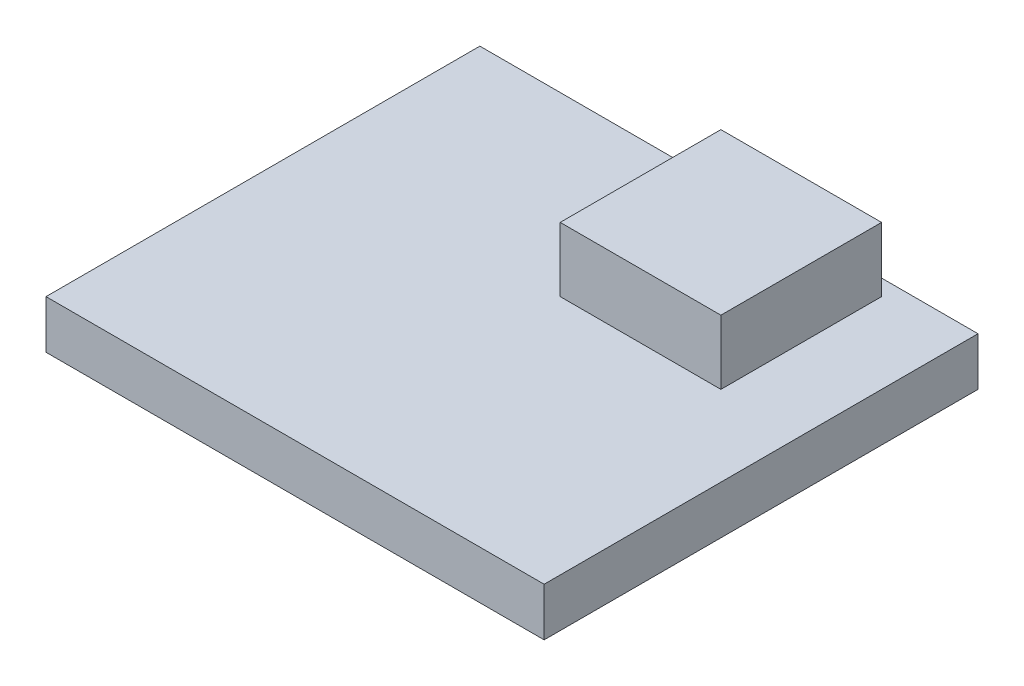
ISO-10303-21;
HEADER;
FILE_DESCRIPTION(('STEP AP214'),'2;1');
FILE_NAME('part.step','',(''),(''),'','','');
FILE_SCHEMA(('AUTOMOTIVE_DESIGN { 1 0 10303 214 1 1 1 1 }'));
ENDSEC;
DATA;
#1=APPLICATION_CONTEXT('core data for automotive mechanical design processes');
#2=APPLICATION_PROTOCOL_DEFINITION('international standard','automotive_design',2000,#1);
#3=PRODUCT_CONTEXT('',#1,'mechanical');
#4=PRODUCT('Part','Part','',(#3));
#5=PRODUCT_RELATED_PRODUCT_CATEGORY('part','',(#4));
#6=PRODUCT_DEFINITION_FORMATION('','',#4);
#7=PRODUCT_DEFINITION_CONTEXT('part definition',#1,'design');
#8=PRODUCT_DEFINITION('design','',#6,#7);
#9=PRODUCT_DEFINITION_SHAPE('','',#8);
#10=(LENGTH_UNIT() NAMED_UNIT(*) SI_UNIT(.MILLI.,.METRE.));
#11=(NAMED_UNIT(*) PLANE_ANGLE_UNIT() SI_UNIT($,.RADIAN.));
#12=(NAMED_UNIT(*) SI_UNIT($,.STERADIAN.) SOLID_ANGLE_UNIT());
#13=UNCERTAINTY_MEASURE_WITH_UNIT(LENGTH_MEASURE(1.E-05),#10,'distance_accuracy_value','');
#14=(GEOMETRIC_REPRESENTATION_CONTEXT(3) GLOBAL_UNCERTAINTY_ASSIGNED_CONTEXT((#13)) GLOBAL_UNIT_ASSIGNED_CONTEXT((#10,
#11,#12)) REPRESENTATION_CONTEXT('',''));
#15=CARTESIAN_POINT('',(0.,0.,0.));
#16=DIRECTION('',(0.,0.,1.));
#17=DIRECTION('',(1.,0.,0.));
#18=AXIS2_PLACEMENT_3D('',#15,#16,#17);
#19=CARTESIAN_POINT('',(0.,3.,0.));
#20=DIRECTION('',(0.,1.,0.));
#21=DIRECTION('',(0.,0.,1.));
#22=AXIS2_PLACEMENT_3D('',#19,#20,#21);
#23=PLANE('',#22);
#24=DIRECTION('',(0.,0.,1.));
#25=VECTOR('',#24,1.);
#26=CARTESIAN_POINT('',(-15.5,3.,-11.7316513761468));
#27=LINE('',#26,#25);
#28=CARTESIAN_POINT('',(-15.5,3.,-11.7316513761468));
#29=VERTEX_POINT('',#28);
#30=CARTESIAN_POINT('',(-15.5,3.,15.2683486238532));
#31=VERTEX_POINT('',#30);
#32=EDGE_CURVE('E140',#29,#31,#27,.T.);
#33=ORIENTED_EDGE('',*,*,#32,.T.);
#34=DIRECTION('',(1.,0.,0.));
#35=VECTOR('',#34,1.);
#36=CARTESIAN_POINT('',(-15.5,3.,15.2683486238532));
#37=LINE('',#36,#35);
#38=CARTESIAN_POINT('',(15.5,3.,15.2683486238532));
#39=VERTEX_POINT('',#38);
#40=EDGE_CURVE('E85',#31,#39,#37,.T.);
#41=ORIENTED_EDGE('',*,*,#40,.T.);
#42=DIRECTION('',(0.,0.,-1.));
#43=VECTOR('',#42,1.);
#44=CARTESIAN_POINT('',(15.5,3.,-11.7316513761468));
#45=LINE('',#44,#43);
#46=CARTESIAN_POINT('',(15.5,3.,-11.7316513761468));
#47=VERTEX_POINT('',#46);
#48=EDGE_CURVE('E143',#39,#47,#45,.T.);
#49=ORIENTED_EDGE('',*,*,#48,.T.);
#50=DIRECTION('',(-1.,0.,0.));
#51=VECTOR('',#50,1.);
#52=CARTESIAN_POINT('',(-15.5,3.,-11.7316513761468));
#53=LINE('',#52,#51);
#54=EDGE_CURVE('E57',#47,#29,#53,.T.);
#55=ORIENTED_EDGE('',*,*,#54,.T.);
#56=EDGE_LOOP('',(#33,#41,#49,#55));
#57=FACE_BOUND('',#56,.T.);
#58=DIRECTION('',(1.,0.,0.));
#59=VECTOR('',#58,1.);
#60=CARTESIAN_POINT('',(0.500000000000014,3.,-0.731651376146787));
#61=LINE('',#60,#59);
#62=CARTESIAN_POINT('',(0.500000000000014,3.,-0.731651376146787));
#63=VERTEX_POINT('',#62);
#64=CARTESIAN_POINT('',(10.5,3.,-0.731651376146787));
#65=VERTEX_POINT('',#64);
#66=EDGE_CURVE('E263',#63,#65,#61,.T.);
#67=ORIENTED_EDGE('',*,*,#66,.F.);
#68=DIRECTION('',(0.,0.,1.));
#69=VECTOR('',#68,1.);
#70=CARTESIAN_POINT('',(0.500000000000013,3.,-10.7316513761468));
#71=LINE('',#70,#69);
#72=CARTESIAN_POINT('',(0.500000000000013,3.,-10.7316513761468));
#73=VERTEX_POINT('',#72);
#74=EDGE_CURVE('E130',#73,#63,#71,.T.);
#75=ORIENTED_EDGE('',*,*,#74,.F.);
#76=DIRECTION('',(-1.,0.,0.));
#77=VECTOR('',#76,1.);
#78=CARTESIAN_POINT('',(0.500000000000013,3.,-10.7316513761468));
#79=LINE('',#78,#77);
#80=CARTESIAN_POINT('',(10.5,3.,-10.7316513761468));
#81=VERTEX_POINT('',#80);
#82=EDGE_CURVE('E126',#81,#73,#79,.T.);
#83=ORIENTED_EDGE('',*,*,#82,.F.);
#84=DIRECTION('',(0.,0.,-1.));
#85=VECTOR('',#84,1.);
#86=CARTESIAN_POINT('',(10.5,3.,-10.7316513761468));
#87=LINE('',#86,#85);
#88=EDGE_CURVE('E260',#65,#81,#87,.T.);
#89=ORIENTED_EDGE('',*,*,#88,.F.);
#90=EDGE_LOOP('',(#67,#75,#83,#89));
#91=FACE_BOUND('',#90,.T.);
#92=ADVANCED_FACE('F33',(#57,#91),#23,.T.);
#93=CARTESIAN_POINT('',(-15.5,3.,-11.7316513761468));
#94=DIRECTION('',(1.,0.,0.));
#95=DIRECTION('',(0.,0.,-1.));
#96=AXIS2_PLACEMENT_3D('',#93,#94,#95);
#97=PLANE('',#96);
#98=DIRECTION('',(0.,0.,1.));
#99=VECTOR('',#98,1.);
#100=CARTESIAN_POINT('',(-15.5,0.,-11.7316513761468));
#101=LINE('',#100,#99);
#102=CARTESIAN_POINT('',(-15.5,0.,-11.7316513761468));
#103=VERTEX_POINT('',#102);
#104=CARTESIAN_POINT('',(-15.5,0.,15.2683486238532));
#105=VERTEX_POINT('',#104);
#106=EDGE_CURVE('E132',#103,#105,#101,.T.);
#107=ORIENTED_EDGE('',*,*,#106,.T.);
#108=DIRECTION('',(0.,-1.,0.));
#109=VECTOR('',#108,1.);
#110=CARTESIAN_POINT('',(-15.5,3.,15.2683486238532));
#111=LINE('',#110,#109);
#112=EDGE_CURVE('E11',#31,#105,#111,.T.);
#113=ORIENTED_EDGE('',*,*,#112,.F.);
#114=ORIENTED_EDGE('',*,*,#32,.F.);
#115=DIRECTION('',(0.,-1.,0.));
#116=VECTOR('',#115,1.);
#117=CARTESIAN_POINT('',(-15.5,3.,-11.7316513761468));
#118=LINE('',#117,#116);
#119=EDGE_CURVE('E145',#29,#103,#118,.T.);
#120=ORIENTED_EDGE('',*,*,#119,.T.);
#121=EDGE_LOOP('',(#107,#113,#114,#120));
#122=FACE_BOUND('',#121,.T.);
#123=ADVANCED_FACE('F35',(#122),#97,.F.);
#124=CARTESIAN_POINT('',(-15.5,3.,15.2683486238532));
#125=DIRECTION('',(0.,0.,-1.));
#126=DIRECTION('',(-1.,0.,0.));
#127=AXIS2_PLACEMENT_3D('',#124,#125,#126);
#128=PLANE('',#127);
#129=DIRECTION('',(1.,0.,0.));
#130=VECTOR('',#129,1.);
#131=CARTESIAN_POINT('',(-15.5,0.,15.2683486238532));
#132=LINE('',#131,#130);
#133=CARTESIAN_POINT('',(15.5,0.,15.2683486238532));
#134=VERTEX_POINT('',#133);
#135=EDGE_CURVE('E135',#105,#134,#132,.T.);
#136=ORIENTED_EDGE('',*,*,#135,.T.);
#137=DIRECTION('',(0.,-1.,0.));
#138=VECTOR('',#137,1.);
#139=CARTESIAN_POINT('',(15.5,3.,15.2683486238532));
#140=LINE('',#139,#138);
#141=EDGE_CURVE('E41',#39,#134,#140,.T.);
#142=ORIENTED_EDGE('',*,*,#141,.F.);
#143=ORIENTED_EDGE('',*,*,#40,.F.);
#144=ORIENTED_EDGE('',*,*,#112,.T.);
#145=EDGE_LOOP('',(#136,#142,#143,#144));
#146=FACE_BOUND('',#145,.T.);
#147=ADVANCED_FACE('F173',(#146),#128,.F.);
#148=CARTESIAN_POINT('',(15.5,3.,-11.7316513761468));
#149=DIRECTION('',(-1.,0.,0.));
#150=DIRECTION('',(0.,0.,1.));
#151=AXIS2_PLACEMENT_3D('',#148,#149,#150);
#152=PLANE('',#151);
#153=DIRECTION('',(0.,0.,-1.));
#154=VECTOR('',#153,1.);
#155=CARTESIAN_POINT('',(15.5,0.,-11.7316513761468));
#156=LINE('',#155,#154);
#157=CARTESIAN_POINT('',(15.5,0.,-11.7316513761468));
#158=VERTEX_POINT('',#157);
#159=EDGE_CURVE('E148',#134,#158,#156,.T.);
#160=ORIENTED_EDGE('',*,*,#159,.T.);
#161=DIRECTION('',(0.,-1.,0.));
#162=VECTOR('',#161,1.);
#163=CARTESIAN_POINT('',(15.5,3.,-11.7316513761468));
#164=LINE('',#163,#162);
#165=EDGE_CURVE('E152',#47,#158,#164,.T.);
#166=ORIENTED_EDGE('',*,*,#165,.F.);
#167=ORIENTED_EDGE('',*,*,#48,.F.);
#168=ORIENTED_EDGE('',*,*,#141,.T.);
#169=EDGE_LOOP('',(#160,#166,#167,#168));
#170=FACE_BOUND('',#169,.T.);
#171=ADVANCED_FACE('F157',(#170),#152,.F.);
#172=CARTESIAN_POINT('',(-15.5,3.,-11.7316513761468));
#173=DIRECTION('',(0.,0.,1.));
#174=DIRECTION('',(1.,0.,0.));
#175=AXIS2_PLACEMENT_3D('',#172,#173,#174);
#176=PLANE('',#175);
#177=DIRECTION('',(-1.,0.,0.));
#178=VECTOR('',#177,1.);
#179=CARTESIAN_POINT('',(-15.5,0.,-11.7316513761468));
#180=LINE('',#179,#178);
#181=EDGE_CURVE('E78',#158,#103,#180,.T.);
#182=ORIENTED_EDGE('',*,*,#181,.T.);
#183=ORIENTED_EDGE('',*,*,#119,.F.);
#184=ORIENTED_EDGE('',*,*,#54,.F.);
#185=ORIENTED_EDGE('',*,*,#165,.T.);
#186=EDGE_LOOP('',(#182,#183,#184,#185));
#187=FACE_BOUND('',#186,.T.);
#188=ADVANCED_FACE('F165',(#187),#176,.F.);
#189=CARTESIAN_POINT('',(0.,0.,0.));
#190=DIRECTION('',(0.,1.,0.));
#191=DIRECTION('',(0.,0.,1.));
#192=AXIS2_PLACEMENT_3D('',#189,#190,#191);
#193=PLANE('',#192);
#194=ORIENTED_EDGE('',*,*,#106,.F.);
#195=ORIENTED_EDGE('',*,*,#181,.F.);
#196=ORIENTED_EDGE('',*,*,#159,.F.);
#197=ORIENTED_EDGE('',*,*,#135,.F.);
#198=EDGE_LOOP('',(#194,#195,#196,#197));
#199=FACE_BOUND('',#198,.T.);
#200=ADVANCED_FACE('F161',(#199),#193,.F.);
#201=CARTESIAN_POINT('',(0.500000000000013,7.,-10.7316513761468));
#202=DIRECTION('',(1.,0.,0.));
#203=DIRECTION('',(0.,0.,-1.));
#204=AXIS2_PLACEMENT_3D('',#201,#202,#203);
#205=PLANE('',#204);
#206=ORIENTED_EDGE('',*,*,#74,.T.);
#207=DIRECTION('',(0.,-1.,0.));
#208=VECTOR('',#207,1.);
#209=CARTESIAN_POINT('',(0.500000000000014,7.,-0.731651376146787));
#210=LINE('',#209,#208);
#211=CARTESIAN_POINT('',(0.500000000000014,7.,-0.731651376146787));
#212=VERTEX_POINT('',#211);
#213=EDGE_CURVE('E111',#212,#63,#210,.T.);
#214=ORIENTED_EDGE('',*,*,#213,.F.);
#215=DIRECTION('',(0.,0.,1.));
#216=VECTOR('',#215,1.);
#217=CARTESIAN_POINT('',(0.500000000000013,7.,-10.7316513761468));
#218=LINE('',#217,#216);
#219=CARTESIAN_POINT('',(0.500000000000013,7.,-10.7316513761468));
#220=VERTEX_POINT('',#219);
#221=EDGE_CURVE('E118',#220,#212,#218,.T.);
#222=ORIENTED_EDGE('',*,*,#221,.F.);
#223=DIRECTION('',(0.,-1.,0.));
#224=VECTOR('',#223,1.);
#225=CARTESIAN_POINT('',(0.500000000000013,7.,-10.7316513761468));
#226=LINE('',#225,#224);
#227=EDGE_CURVE('E258',#220,#73,#226,.T.);
#228=ORIENTED_EDGE('',*,*,#227,.T.);
#229=EDGE_LOOP('',(#206,#214,#222,#228));
#230=FACE_BOUND('',#229,.T.);
#231=ADVANCED_FACE('F128',(#230),#205,.F.);
#232=CARTESIAN_POINT('',(0.500000000000014,7.,-0.731651376146787));
#233=DIRECTION('',(0.,0.,-1.));
#234=DIRECTION('',(-1.,0.,0.));
#235=AXIS2_PLACEMENT_3D('',#232,#233,#234);
#236=PLANE('',#235);
#237=ORIENTED_EDGE('',*,*,#66,.T.);
#238=DIRECTION('',(0.,-1.,0.));
#239=VECTOR('',#238,1.);
#240=CARTESIAN_POINT('',(10.5,7.,-0.731651376146787));
#241=LINE('',#240,#239);
#242=CARTESIAN_POINT('',(10.5,7.,-0.731651376146787));
#243=VERTEX_POINT('',#242);
#244=EDGE_CURVE('E114',#243,#65,#241,.T.);
#245=ORIENTED_EDGE('',*,*,#244,.F.);
#246=DIRECTION('',(1.,0.,0.));
#247=VECTOR('',#246,1.);
#248=CARTESIAN_POINT('',(0.500000000000014,7.,-0.731651376146787));
#249=LINE('',#248,#247);
#250=EDGE_CURVE('E107',#212,#243,#249,.T.);
#251=ORIENTED_EDGE('',*,*,#250,.F.);
#252=ORIENTED_EDGE('',*,*,#213,.T.);
#253=EDGE_LOOP('',(#237,#245,#251,#252));
#254=FACE_BOUND('',#253,.T.);
#255=ADVANCED_FACE('F109',(#254),#236,.F.);
#256=CARTESIAN_POINT('',(10.5,7.,-10.7316513761468));
#257=DIRECTION('',(-1.,0.,0.));
#258=DIRECTION('',(0.,0.,1.));
#259=AXIS2_PLACEMENT_3D('',#256,#257,#258);
#260=PLANE('',#259);
#261=ORIENTED_EDGE('',*,*,#88,.T.);
#262=DIRECTION('',(0.,-1.,0.));
#263=VECTOR('',#262,1.);
#264=CARTESIAN_POINT('',(10.5,7.,-10.7316513761468));
#265=LINE('',#264,#263);
#266=CARTESIAN_POINT('',(10.5,7.,-10.7316513761468));
#267=VERTEX_POINT('',#266);
#268=EDGE_CURVE('E48',#267,#81,#265,.T.);
#269=ORIENTED_EDGE('',*,*,#268,.F.);
#270=DIRECTION('',(0.,0.,-1.));
#271=VECTOR('',#270,1.);
#272=CARTESIAN_POINT('',(10.5,7.,-10.7316513761468));
#273=LINE('',#272,#271);
#274=EDGE_CURVE('E117',#243,#267,#273,.T.);
#275=ORIENTED_EDGE('',*,*,#274,.F.);
#276=ORIENTED_EDGE('',*,*,#244,.T.);
#277=EDGE_LOOP('',(#261,#269,#275,#276));
#278=FACE_BOUND('',#277,.T.);
#279=ADVANCED_FACE('F186',(#278),#260,.F.);
#280=CARTESIAN_POINT('',(0.500000000000013,7.,-10.7316513761468));
#281=DIRECTION('',(0.,0.,1.));
#282=DIRECTION('',(1.,0.,0.));
#283=AXIS2_PLACEMENT_3D('',#280,#281,#282);
#284=PLANE('',#283);
#285=ORIENTED_EDGE('',*,*,#82,.T.);
#286=ORIENTED_EDGE('',*,*,#227,.F.);
#287=DIRECTION('',(-1.,0.,0.));
#288=VECTOR('',#287,1.);
#289=CARTESIAN_POINT('',(0.500000000000013,7.,-10.7316513761468));
#290=LINE('',#289,#288);
#291=EDGE_CURVE('E122',#267,#220,#290,.T.);
#292=ORIENTED_EDGE('',*,*,#291,.F.);
#293=ORIENTED_EDGE('',*,*,#268,.T.);
#294=EDGE_LOOP('',(#285,#286,#292,#293));
#295=FACE_BOUND('',#294,.T.);
#296=ADVANCED_FACE('F189',(#295),#284,.F.);
#297=CARTESIAN_POINT('',(0.,7.,0.));
#298=DIRECTION('',(0.,1.,0.));
#299=DIRECTION('',(0.,0.,1.));
#300=AXIS2_PLACEMENT_3D('',#297,#298,#299);
#301=PLANE('',#300);
#302=ORIENTED_EDGE('',*,*,#221,.T.);
#303=ORIENTED_EDGE('',*,*,#250,.T.);
#304=ORIENTED_EDGE('',*,*,#274,.T.);
#305=ORIENTED_EDGE('',*,*,#291,.T.);
#306=EDGE_LOOP('',(#302,#303,#304,#305));
#307=FACE_BOUND('',#306,.T.);
#308=ADVANCED_FACE('F121',(#307),#301,.T.);
#309=CLOSED_SHELL('',(#92,#123,#147,#171,#188,#200,#231,#255,#279,#296,#308));
#310=MANIFOLD_SOLID_BREP('B2',#309);
#311=ADVANCED_BREP_SHAPE_REPRESENTATION('',(#18,#310),#14);
#312=SHAPE_DEFINITION_REPRESENTATION(#9,#311);
ENDSEC;
END-ISO-10303-21;
